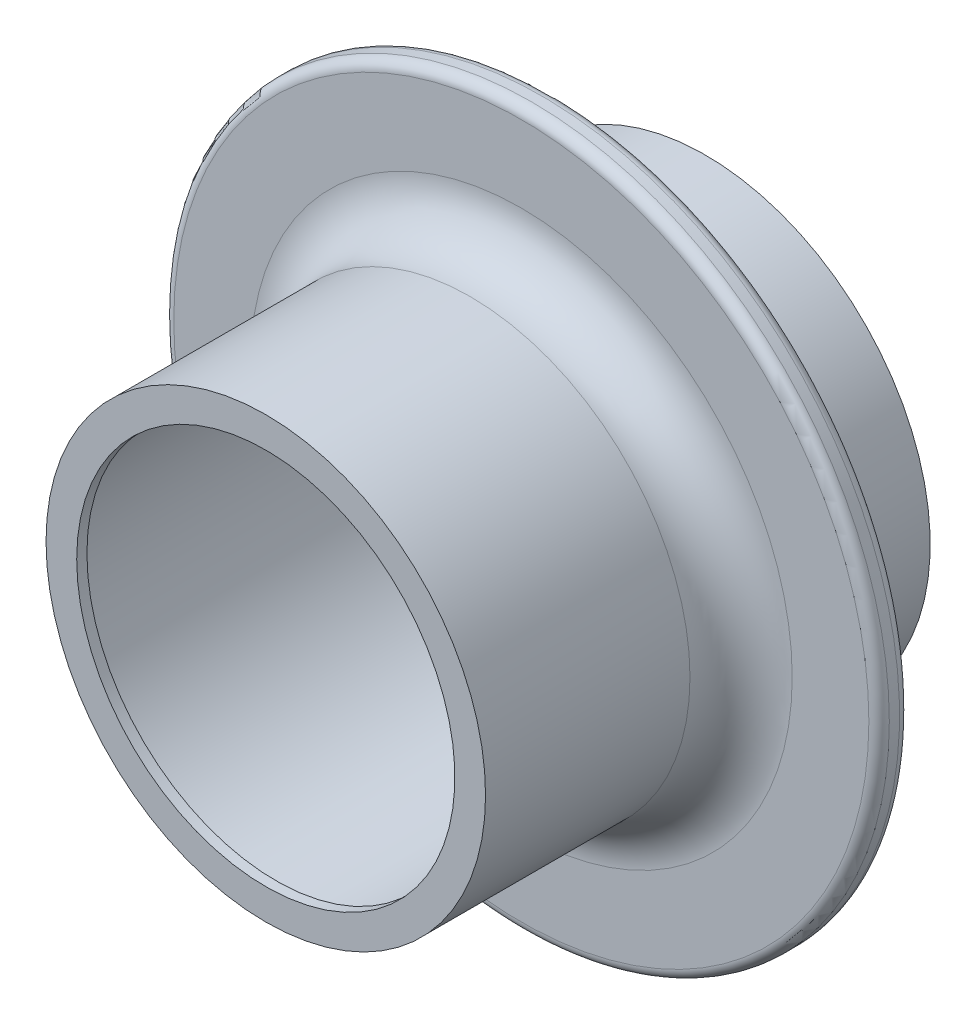
ISO-10303-21;
HEADER;
FILE_DESCRIPTION(('STEP AP214'),'2;1');
FILE_NAME('part.step','',(''),(''),'','','');
FILE_SCHEMA(('AUTOMOTIVE_DESIGN { 1 0 10303 214 1 1 1 1 }'));
ENDSEC;
DATA;
#1=APPLICATION_CONTEXT('core data for automotive mechanical design processes');
#2=APPLICATION_PROTOCOL_DEFINITION('international standard','automotive_design',2000,#1);
#3=PRODUCT_CONTEXT('',#1,'mechanical');
#4=PRODUCT('Part','Part','',(#3));
#5=PRODUCT_RELATED_PRODUCT_CATEGORY('part','',(#4));
#6=PRODUCT_DEFINITION_FORMATION('','',#4);
#7=PRODUCT_DEFINITION_CONTEXT('part definition',#1,'design');
#8=PRODUCT_DEFINITION('design','',#6,#7);
#9=PRODUCT_DEFINITION_SHAPE('','',#8);
#10=(LENGTH_UNIT() NAMED_UNIT(*) SI_UNIT(.MILLI.,.METRE.));
#11=(NAMED_UNIT(*) PLANE_ANGLE_UNIT() SI_UNIT($,.RADIAN.));
#12=(NAMED_UNIT(*) SI_UNIT($,.STERADIAN.) SOLID_ANGLE_UNIT());
#13=UNCERTAINTY_MEASURE_WITH_UNIT(LENGTH_MEASURE(1.E-05),#10,'distance_accuracy_value','');
#14=(GEOMETRIC_REPRESENTATION_CONTEXT(3) GLOBAL_UNCERTAINTY_ASSIGNED_CONTEXT((#13)) GLOBAL_UNIT_ASSIGNED_CONTEXT((#10,
#11,#12)) REPRESENTATION_CONTEXT('',''));
#15=CARTESIAN_POINT('',(0.,0.,0.));
#16=DIRECTION('',(0.,0.,1.));
#17=DIRECTION('',(1.,0.,0.));
#18=AXIS2_PLACEMENT_3D('',#15,#16,#17);
#19=CARTESIAN_POINT('',(0.,0.,43.));
#20=DIRECTION('',(0.,0.,-1.));
#21=DIRECTION('',(-1.,0.,0.));
#22=AXIS2_PLACEMENT_3D('',#19,#20,#21);
#23=CYLINDRICAL_SURFACE('',#22,18.5);
#24=CARTESIAN_POINT('',(0.,0.,43.));
#25=DIRECTION('',(0.,0.,-1.));
#26=DIRECTION('',(-1.,0.,0.));
#27=AXIS2_PLACEMENT_3D('',#24,#25,#26);
#28=CIRCLE('',#27,18.5);
#29=CARTESIAN_POINT('',(-18.5,0.,43.));
#30=VERTEX_POINT('',#29);
#31=EDGE_CURVE('E68',#30,#30,#28,.T.);
#32=ORIENTED_EDGE('',*,*,#31,.F.);
#33=EDGE_LOOP('',(#32));
#34=FACE_BOUND('',#33,.T.);
#35=CARTESIAN_POINT('',(0.,0.,42.));
#36=DIRECTION('',(0.,0.,-1.));
#37=DIRECTION('',(-1.,0.,0.));
#38=AXIS2_PLACEMENT_3D('',#35,#36,#37);
#39=CIRCLE('',#38,18.5);
#40=CARTESIAN_POINT('',(-18.5,0.,42.));
#41=VERTEX_POINT('',#40);
#42=EDGE_CURVE('E65',#41,#41,#39,.F.);
#43=ORIENTED_EDGE('',*,*,#42,.F.);
#44=EDGE_LOOP('',(#43));
#45=FACE_BOUND('',#44,.T.);
#46=ADVANCED_FACE('F32',(#34,#45),#23,.F.);
#47=CARTESIAN_POINT('',(0.,0.,43.));
#48=DIRECTION('',(0.,0.,-1.));
#49=DIRECTION('',(-1.,0.,0.));
#50=AXIS2_PLACEMENT_3D('',#47,#48,#49);
#51=CYLINDRICAL_SURFACE('',#50,35.);
#52=CARTESIAN_POINT('',(0.,0.,17.));
#53=DIRECTION('',(0.,0.,1.));
#54=DIRECTION('',(1.,0.,0.));
#55=AXIS2_PLACEMENT_3D('',#52,#53,#54);
#56=CIRCLE('',#55,35.);
#57=CARTESIAN_POINT('',(35.,0.,17.));
#58=VERTEX_POINT('',#57);
#59=EDGE_CURVE('E39',#58,#58,#56,.F.);
#60=ORIENTED_EDGE('',*,*,#59,.T.);
#61=EDGE_LOOP('',(#60));
#62=FACE_BOUND('',#61,.T.);
#63=CARTESIAN_POINT('',(0.,0.,16.));
#64=DIRECTION('',(0.,0.,-1.));
#65=DIRECTION('',(-1.,0.,0.));
#66=AXIS2_PLACEMENT_3D('',#63,#64,#65);
#67=CIRCLE('',#66,35.);
#68=CARTESIAN_POINT('',(-35.,0.,16.));
#69=VERTEX_POINT('',#68);
#70=EDGE_CURVE('E43',#69,#69,#67,.F.);
#71=ORIENTED_EDGE('',*,*,#70,.T.);
#72=EDGE_LOOP('',(#71));
#73=FACE_BOUND('',#72,.T.);
#74=ADVANCED_FACE('F108',(#62,#73),#51,.T.);
#75=CARTESIAN_POINT('',(0.,0.,15.));
#76=DIRECTION('',(0.,0.,-1.));
#77=DIRECTION('',(-1.,0.,0.));
#78=AXIS2_PLACEMENT_3D('',#75,#76,#77);
#79=PLANE('',#78);
#80=CARTESIAN_POINT('',(0.,0.,15.));
#81=DIRECTION('',(0.,0.,-1.));
#82=DIRECTION('',(-1.,0.,0.));
#83=AXIS2_PLACEMENT_3D('',#80,#81,#82);
#84=CIRCLE('',#83,34.);
#85=CARTESIAN_POINT('',(-34.,0.,15.));
#86=VERTEX_POINT('',#85);
#87=EDGE_CURVE('E10',#86,#86,#84,.T.);
#88=ORIENTED_EDGE('',*,*,#87,.T.);
#89=EDGE_LOOP('',(#88));
#90=FACE_BOUND('',#89,.T.);
#91=CARTESIAN_POINT('',(0.,0.,15.));
#92=DIRECTION('',(0.,0.,-1.));
#93=DIRECTION('',(-1.,0.,0.));
#94=AXIS2_PLACEMENT_3D('',#91,#92,#93);
#95=CIRCLE('',#94,27.);
#96=CARTESIAN_POINT('',(-27.,0.,15.));
#97=VERTEX_POINT('',#96);
#98=EDGE_CURVE('E52',#97,#97,#95,.F.);
#99=ORIENTED_EDGE('',*,*,#98,.T.);
#100=EDGE_LOOP('',(#99));
#101=FACE_BOUND('',#100,.T.);
#102=ADVANCED_FACE('F102',(#90,#101),#79,.T.);
#103=CARTESIAN_POINT('',(0.,0.,15.));
#104=DIRECTION('',(0.,0.,-1.));
#105=DIRECTION('',(-1.,0.,0.));
#106=AXIS2_PLACEMENT_3D('',#103,#104,#105);
#107=CYLINDRICAL_SURFACE('',#106,22.);
#108=CARTESIAN_POINT('',(0.,0.,10.));
#109=DIRECTION('',(0.,0.,-1.));
#110=DIRECTION('',(-1.,0.,0.));
#111=AXIS2_PLACEMENT_3D('',#108,#109,#110);
#112=CIRCLE('',#111,22.);
#113=CARTESIAN_POINT('',(-22.,0.,10.));
#114=VERTEX_POINT('',#113);
#115=EDGE_CURVE('E55',#114,#114,#112,.T.);
#116=ORIENTED_EDGE('',*,*,#115,.T.);
#117=EDGE_LOOP('',(#116));
#118=FACE_BOUND('',#117,.T.);
#119=CARTESIAN_POINT('',(0.,0.,0.));
#120=DIRECTION('',(0.,0.,-1.));
#121=DIRECTION('',(-1.,0.,0.));
#122=AXIS2_PLACEMENT_3D('',#119,#120,#121);
#123=CIRCLE('',#122,22.);
#124=CARTESIAN_POINT('',(-22.,0.,0.));
#125=VERTEX_POINT('',#124);
#126=EDGE_CURVE('E64',#125,#125,#123,.T.);
#127=ORIENTED_EDGE('',*,*,#126,.F.);
#128=EDGE_LOOP('',(#127));
#129=FACE_BOUND('',#128,.T.);
#130=ADVANCED_FACE('F97',(#118,#129),#107,.T.);
#131=CARTESIAN_POINT('',(0.,0.,0.));
#132=DIRECTION('',(0.,0.,1.));
#133=DIRECTION('',(1.,0.,0.));
#134=AXIS2_PLACEMENT_3D('',#131,#132,#133);
#135=PLANE('',#134);
#136=CARTESIAN_POINT('',(0.,0.,0.));
#137=DIRECTION('',(0.,0.,-1.));
#138=DIRECTION('',(-1.,0.,0.));
#139=AXIS2_PLACEMENT_3D('',#136,#137,#138);
#140=CIRCLE('',#139,20.);
#141=CARTESIAN_POINT('',(-20.,0.,0.));
#142=VERTEX_POINT('',#141);
#143=EDGE_CURVE('E77',#142,#142,#140,.T.);
#144=ORIENTED_EDGE('',*,*,#143,.F.);
#145=EDGE_LOOP('',(#144));
#146=FACE_BOUND('',#145,.T.);
#147=ORIENTED_EDGE('',*,*,#126,.T.);
#148=EDGE_LOOP('',(#147));
#149=FACE_BOUND('',#148,.T.);
#150=ADVANCED_FACE('F93',(#146,#149),#135,.F.);
#151=CARTESIAN_POINT('',(0.,0.,18.));
#152=DIRECTION('',(0.,0.,1.));
#153=DIRECTION('',(1.,0.,0.));
#154=AXIS2_PLACEMENT_3D('',#151,#152,#153);
#155=PLANE('',#154);
#156=CARTESIAN_POINT('',(0.,0.,18.));
#157=DIRECTION('',(0.,0.,1.));
#158=DIRECTION('',(1.,0.,0.));
#159=AXIS2_PLACEMENT_3D('',#156,#157,#158);
#160=CIRCLE('',#159,34.);
#161=CARTESIAN_POINT('',(34.,0.,18.));
#162=VERTEX_POINT('',#161);
#163=EDGE_CURVE('E47',#162,#162,#160,.T.);
#164=ORIENTED_EDGE('',*,*,#163,.T.);
#165=EDGE_LOOP('',(#164));
#166=FACE_BOUND('',#165,.T.);
#167=CARTESIAN_POINT('',(0.,0.,18.));
#168=DIRECTION('',(0.,0.,1.));
#169=DIRECTION('',(1.,0.,0.));
#170=AXIS2_PLACEMENT_3D('',#167,#168,#169);
#171=CIRCLE('',#170,26.5);
#172=CARTESIAN_POINT('',(26.5,0.,18.));
#173=VERTEX_POINT('',#172);
#174=EDGE_CURVE('E58',#173,#173,#171,.F.);
#175=ORIENTED_EDGE('',*,*,#174,.T.);
#176=EDGE_LOOP('',(#175));
#177=FACE_BOUND('',#176,.T.);
#178=ADVANCED_FACE('F96',(#166,#177),#155,.T.);
#179=CARTESIAN_POINT('',(0.,0.,18.));
#180=DIRECTION('',(0.,0.,1.));
#181=DIRECTION('',(1.,0.,0.));
#182=AXIS2_PLACEMENT_3D('',#179,#180,#181);
#183=CYLINDRICAL_SURFACE('',#182,21.5);
#184=CARTESIAN_POINT('',(0.,0.,23.));
#185=DIRECTION('',(0.,0.,1.));
#186=DIRECTION('',(1.,0.,0.));
#187=AXIS2_PLACEMENT_3D('',#184,#185,#186);
#188=CIRCLE('',#187,21.5);
#189=CARTESIAN_POINT('',(21.5,0.,23.));
#190=VERTEX_POINT('',#189);
#191=EDGE_CURVE('E61',#190,#190,#188,.T.);
#192=ORIENTED_EDGE('',*,*,#191,.T.);
#193=EDGE_LOOP('',(#192));
#194=FACE_BOUND('',#193,.T.);
#195=CARTESIAN_POINT('',(0.,0.,43.));
#196=DIRECTION('',(0.,0.,1.));
#197=DIRECTION('',(1.,0.,0.));
#198=AXIS2_PLACEMENT_3D('',#195,#196,#197);
#199=CIRCLE('',#198,21.5);
#200=CARTESIAN_POINT('',(21.5,0.,43.));
#201=VERTEX_POINT('',#200);
#202=EDGE_CURVE('E72',#201,#201,#199,.T.);
#203=ORIENTED_EDGE('',*,*,#202,.F.);
#204=EDGE_LOOP('',(#203));
#205=FACE_BOUND('',#204,.T.);
#206=ADVANCED_FACE('F122',(#194,#205),#183,.T.);
#207=CARTESIAN_POINT('',(0.,0.,43.));
#208=DIRECTION('',(0.,0.,1.));
#209=DIRECTION('',(1.,0.,0.));
#210=AXIS2_PLACEMENT_3D('',#207,#208,#209);
#211=PLANE('',#210);
#212=ORIENTED_EDGE('',*,*,#31,.T.);
#213=EDGE_LOOP('',(#212));
#214=FACE_BOUND('',#213,.T.);
#215=ORIENTED_EDGE('',*,*,#202,.T.);
#216=EDGE_LOOP('',(#215));
#217=FACE_BOUND('',#216,.T.);
#218=ADVANCED_FACE('F124',(#214,#217),#211,.T.);
#219=CARTESIAN_POINT('',(0.,0.,42.));
#220=DIRECTION('',(0.,0.,-1.));
#221=DIRECTION('',(-1.,0.,0.));
#222=AXIS2_PLACEMENT_3D('',#219,#220,#221);
#223=PLANE('',#222);
#224=CARTESIAN_POINT('',(0.,0.,42.));
#225=DIRECTION('',(0.,0.,-1.));
#226=DIRECTION('',(-1.,0.,0.));
#227=AXIS2_PLACEMENT_3D('',#224,#225,#226);
#228=CIRCLE('',#227,20.);
#229=CARTESIAN_POINT('',(-20.,0.,42.));
#230=VERTEX_POINT('',#229);
#231=EDGE_CURVE('E69',#230,#230,#228,.T.);
#232=ORIENTED_EDGE('',*,*,#231,.T.);
#233=EDGE_LOOP('',(#232));
#234=FACE_BOUND('',#233,.T.);
#235=ORIENTED_EDGE('',*,*,#42,.T.);
#236=EDGE_LOOP('',(#235));
#237=FACE_BOUND('',#236,.T.);
#238=ADVANCED_FACE('F83',(#234,#237),#223,.T.);
#239=CARTESIAN_POINT('',(0.,0.,42.));
#240=DIRECTION('',(0.,0.,-1.));
#241=DIRECTION('',(-1.,0.,0.));
#242=AXIS2_PLACEMENT_3D('',#239,#240,#241);
#243=CYLINDRICAL_SURFACE('',#242,20.);
#244=ORIENTED_EDGE('',*,*,#231,.F.);
#245=EDGE_LOOP('',(#244));
#246=FACE_BOUND('',#245,.T.);
#247=ORIENTED_EDGE('',*,*,#143,.T.);
#248=EDGE_LOOP('',(#247));
#249=FACE_BOUND('',#248,.T.);
#250=ADVANCED_FACE('F86',(#246,#249),#243,.F.);
#251=CARTESIAN_POINT('',(0.,0.,23.));
#252=DIRECTION('',(0.,0.,1.));
#253=DIRECTION('',(1.,0.,0.));
#254=AXIS2_PLACEMENT_3D('',#251,#252,#253);
#255=TOROIDAL_SURFACE('',#254,26.5,5.);
#256=ORIENTED_EDGE('',*,*,#174,.F.);
#257=EDGE_LOOP('',(#256));
#258=FACE_BOUND('',#257,.T.);
#259=ORIENTED_EDGE('',*,*,#191,.F.);
#260=EDGE_LOOP('',(#259));
#261=FACE_BOUND('',#260,.T.);
#262=ADVANCED_FACE('F89',(#258,#261),#255,.F.);
#263=CARTESIAN_POINT('',(0.,0.,10.));
#264=DIRECTION('',(0.,0.,-1.));
#265=DIRECTION('',(-1.,0.,0.));
#266=AXIS2_PLACEMENT_3D('',#263,#264,#265);
#267=TOROIDAL_SURFACE('',#266,27.,5.);
#268=ORIENTED_EDGE('',*,*,#98,.F.);
#269=EDGE_LOOP('',(#268));
#270=FACE_BOUND('',#269,.T.);
#271=ORIENTED_EDGE('',*,*,#115,.F.);
#272=EDGE_LOOP('',(#271));
#273=FACE_BOUND('',#272,.T.);
#274=ADVANCED_FACE('F136',(#270,#273),#267,.F.);
#275=CARTESIAN_POINT('',(0.,0.,17.));
#276=DIRECTION('',(0.,0.,1.));
#277=DIRECTION('',(1.,0.,0.));
#278=AXIS2_PLACEMENT_3D('',#275,#276,#277);
#279=TOROIDAL_SURFACE('',#278,34.,1.);
#280=ORIENTED_EDGE('',*,*,#59,.F.);
#281=EDGE_LOOP('',(#280));
#282=FACE_BOUND('',#281,.T.);
#283=ORIENTED_EDGE('',*,*,#163,.F.);
#284=EDGE_LOOP('',(#283));
#285=FACE_BOUND('',#284,.T.);
#286=ADVANCED_FACE('F150',(#282,#285),#279,.T.);
#287=CARTESIAN_POINT('',(0.,0.,16.));
#288=DIRECTION('',(0.,0.,-1.));
#289=DIRECTION('',(-1.,0.,0.));
#290=AXIS2_PLACEMENT_3D('',#287,#288,#289);
#291=TOROIDAL_SURFACE('',#290,34.,1.);
#292=ORIENTED_EDGE('',*,*,#70,.F.);
#293=EDGE_LOOP('',(#292));
#294=FACE_BOUND('',#293,.T.);
#295=ORIENTED_EDGE('',*,*,#87,.F.);
#296=EDGE_LOOP('',(#295));
#297=FACE_BOUND('',#296,.T.);
#298=ADVANCED_FACE('F34',(#294,#297),#291,.T.);
#299=CLOSED_SHELL('',(#46,#74,#102,#130,#150,#178,#206,#218,#238,#250,#262,#274,#286,#298));
#300=MANIFOLD_SOLID_BREP('B2',#299);
#301=ADVANCED_BREP_SHAPE_REPRESENTATION('',(#18,#300),#14);
#302=SHAPE_DEFINITION_REPRESENTATION(#9,#301);
ENDSEC;
END-ISO-10303-21;
